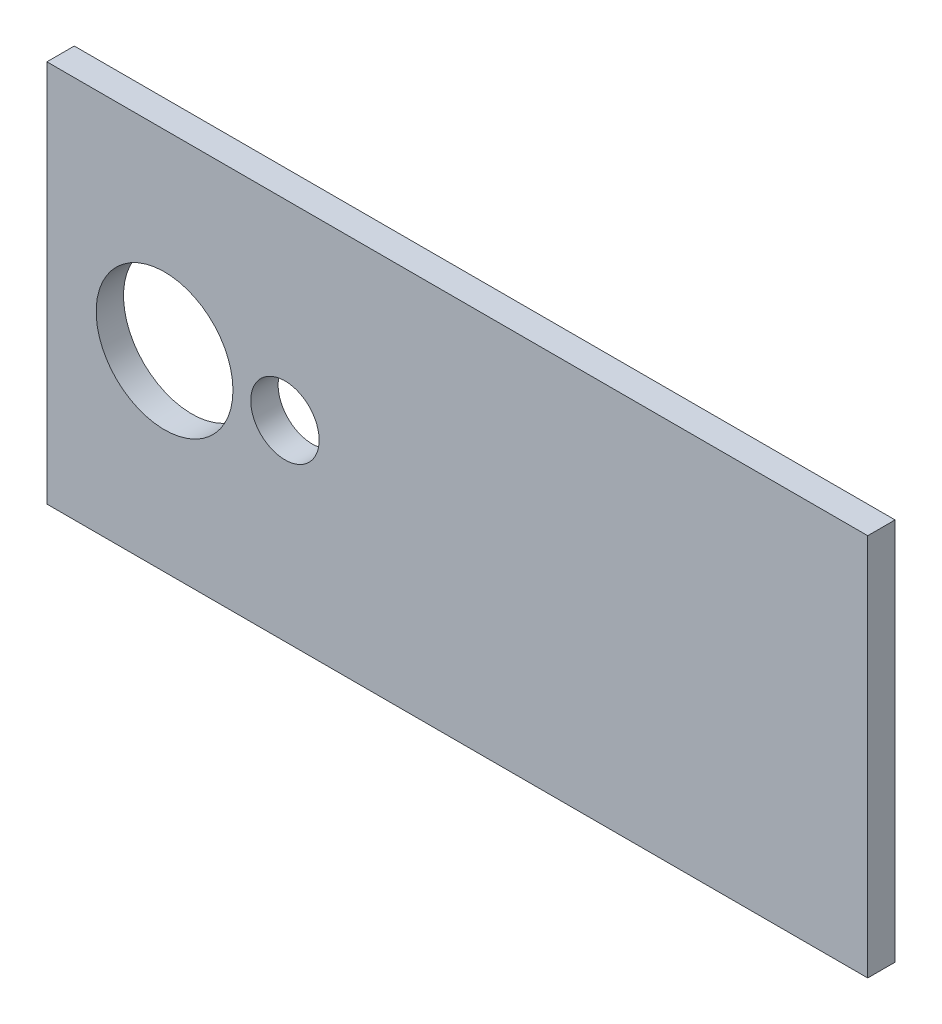
ISO-10303-21;
HEADER;
FILE_DESCRIPTION(('STEP AP214'),'2;1');
FILE_NAME('part.step','',(''),(''),'','','');
FILE_SCHEMA(('AUTOMOTIVE_DESIGN { 1 0 10303 214 1 1 1 1 }'));
ENDSEC;
DATA;
#1=APPLICATION_CONTEXT('core data for automotive mechanical design processes');
#2=APPLICATION_PROTOCOL_DEFINITION('international standard','automotive_design',2000,#1);
#3=PRODUCT_CONTEXT('',#1,'mechanical');
#4=PRODUCT('Part','Part','',(#3));
#5=PRODUCT_RELATED_PRODUCT_CATEGORY('part','',(#4));
#6=PRODUCT_DEFINITION_FORMATION('','',#4);
#7=PRODUCT_DEFINITION_CONTEXT('part definition',#1,'design');
#8=PRODUCT_DEFINITION('design','',#6,#7);
#9=PRODUCT_DEFINITION_SHAPE('','',#8);
#10=(LENGTH_UNIT() NAMED_UNIT(*) SI_UNIT(.MILLI.,.METRE.));
#11=(NAMED_UNIT(*) PLANE_ANGLE_UNIT() SI_UNIT($,.RADIAN.));
#12=(NAMED_UNIT(*) SI_UNIT($,.STERADIAN.) SOLID_ANGLE_UNIT());
#13=UNCERTAINTY_MEASURE_WITH_UNIT(LENGTH_MEASURE(1.E-05),#10,'distance_accuracy_value','');
#14=(GEOMETRIC_REPRESENTATION_CONTEXT(3) GLOBAL_UNCERTAINTY_ASSIGNED_CONTEXT((#13)) GLOBAL_UNIT_ASSIGNED_CONTEXT((#10,
#11,#12)) REPRESENTATION_CONTEXT('',''));
#15=CARTESIAN_POINT('',(0.,0.,0.));
#16=DIRECTION('',(0.,0.,1.));
#17=DIRECTION('',(1.,0.,0.));
#18=AXIS2_PLACEMENT_3D('',#15,#16,#17);
#19=CARTESIAN_POINT('',(0.,0.,3.175));
#20=DIRECTION('',(0.,0.,1.));
#21=DIRECTION('',(1.,0.,0.));
#22=AXIS2_PLACEMENT_3D('',#19,#20,#21);
#23=PLANE('',#22);
#24=CARTESIAN_POINT('',(-67.945,0.,3.175));
#25=DIRECTION('',(0.,0.,1.));
#26=DIRECTION('',(1.,0.,0.));
#27=AXIS2_PLACEMENT_3D('',#24,#25,#26);
#28=CIRCLE('',#27,15.875);
#29=CARTESIAN_POINT('',(-52.07,0.,3.175));
#30=VERTEX_POINT('',#29);
#31=EDGE_CURVE('E99',#30,#30,#28,.T.);
#32=ORIENTED_EDGE('',*,*,#31,.F.);
#33=EDGE_LOOP('',(#32));
#34=FACE_BOUND('',#33,.T.);
#35=DIRECTION('',(0.,1.,0.));
#36=VECTOR('',#35,1.);
#37=CARTESIAN_POINT('',(95.25,44.45,3.175));
#38=LINE('',#37,#36);
#39=CARTESIAN_POINT('',(95.25,-44.45,3.175));
#40=VERTEX_POINT('',#39);
#41=CARTESIAN_POINT('',(95.25,44.45,3.175));
#42=VERTEX_POINT('',#41);
#43=EDGE_CURVE('E84',#40,#42,#38,.T.);
#44=ORIENTED_EDGE('',*,*,#43,.T.);
#45=DIRECTION('',(-1.,0.,0.));
#46=VECTOR('',#45,1.);
#47=CARTESIAN_POINT('',(-95.25,44.45,3.175));
#48=LINE('',#47,#46);
#49=CARTESIAN_POINT('',(-95.25,44.45,3.175));
#50=VERTEX_POINT('',#49);
#51=EDGE_CURVE('E79',#42,#50,#48,.T.);
#52=ORIENTED_EDGE('',*,*,#51,.T.);
#53=DIRECTION('',(0.,-1.,0.));
#54=VECTOR('',#53,1.);
#55=CARTESIAN_POINT('',(-95.25,44.45,3.175));
#56=LINE('',#55,#54);
#57=CARTESIAN_POINT('',(-95.25,-44.45,3.175));
#58=VERTEX_POINT('',#57);
#59=EDGE_CURVE('E82',#50,#58,#56,.T.);
#60=ORIENTED_EDGE('',*,*,#59,.T.);
#61=DIRECTION('',(1.,0.,0.));
#62=VECTOR('',#61,1.);
#63=CARTESIAN_POINT('',(-95.25,-44.45,3.175));
#64=LINE('',#63,#62);
#65=EDGE_CURVE('E49',#58,#40,#64,.T.);
#66=ORIENTED_EDGE('',*,*,#65,.T.);
#67=EDGE_LOOP('',(#44,#52,#60,#66));
#68=FACE_BOUND('',#67,.T.);
#69=CARTESIAN_POINT('',(-40.005,0.,3.175));
#70=DIRECTION('',(0.,0.,1.));
#71=DIRECTION('',(1.,0.,0.));
#72=AXIS2_PLACEMENT_3D('',#69,#70,#71);
#73=CIRCLE('',#72,7.9375);
#74=CARTESIAN_POINT('',(-32.0675,0.,3.175));
#75=VERTEX_POINT('',#74);
#76=EDGE_CURVE('E114',#75,#75,#73,.T.);
#77=ORIENTED_EDGE('',*,*,#76,.F.);
#78=EDGE_LOOP('',(#77));
#79=FACE_BOUND('',#78,.T.);
#80=ADVANCED_FACE('F32',(#34,#68,#79),#23,.T.);
#81=CARTESIAN_POINT('',(0.,0.,-3.175));
#82=DIRECTION('',(0.,0.,1.));
#83=DIRECTION('',(1.,0.,0.));
#84=AXIS2_PLACEMENT_3D('',#81,#82,#83);
#85=PLANE('',#84);
#86=CARTESIAN_POINT('',(-67.945,0.,-3.175));
#87=DIRECTION('',(0.,0.,1.));
#88=DIRECTION('',(1.,0.,0.));
#89=AXIS2_PLACEMENT_3D('',#86,#87,#88);
#90=CIRCLE('',#89,15.875);
#91=CARTESIAN_POINT('',(-52.07,0.,-3.175));
#92=VERTEX_POINT('',#91);
#93=EDGE_CURVE('E111',#92,#92,#90,.T.);
#94=ORIENTED_EDGE('',*,*,#93,.T.);
#95=EDGE_LOOP('',(#94));
#96=FACE_BOUND('',#95,.T.);
#97=DIRECTION('',(0.,1.,0.));
#98=VECTOR('',#97,1.);
#99=CARTESIAN_POINT('',(95.25,44.45,-3.175));
#100=LINE('',#99,#98);
#101=CARTESIAN_POINT('',(95.25,-44.45,-3.175));
#102=VERTEX_POINT('',#101);
#103=CARTESIAN_POINT('',(95.25,44.45,-3.175));
#104=VERTEX_POINT('',#103);
#105=EDGE_CURVE('E96',#102,#104,#100,.T.);
#106=ORIENTED_EDGE('',*,*,#105,.F.);
#107=DIRECTION('',(1.,0.,0.));
#108=VECTOR('',#107,1.);
#109=CARTESIAN_POINT('',(-95.25,-44.45,-3.175));
#110=LINE('',#109,#108);
#111=CARTESIAN_POINT('',(-95.25,-44.45,-3.175));
#112=VERTEX_POINT('',#111);
#113=EDGE_CURVE('E72',#112,#102,#110,.T.);
#114=ORIENTED_EDGE('',*,*,#113,.F.);
#115=DIRECTION('',(0.,-1.,0.));
#116=VECTOR('',#115,1.);
#117=CARTESIAN_POINT('',(-95.25,44.45,-3.175));
#118=LINE('',#117,#116);
#119=CARTESIAN_POINT('',(-95.25,44.45,-3.175));
#120=VERTEX_POINT('',#119);
#121=EDGE_CURVE('E66',#120,#112,#118,.T.);
#122=ORIENTED_EDGE('',*,*,#121,.F.);
#123=DIRECTION('',(-1.,0.,0.));
#124=VECTOR('',#123,1.);
#125=CARTESIAN_POINT('',(-95.25,44.45,-3.175));
#126=LINE('',#125,#124);
#127=EDGE_CURVE('E88',#104,#120,#126,.T.);
#128=ORIENTED_EDGE('',*,*,#127,.F.);
#129=EDGE_LOOP('',(#106,#114,#122,#128));
#130=FACE_BOUND('',#129,.T.);
#131=CARTESIAN_POINT('',(-40.005,0.,-3.175));
#132=DIRECTION('',(0.,0.,1.));
#133=DIRECTION('',(1.,0.,0.));
#134=AXIS2_PLACEMENT_3D('',#131,#132,#133);
#135=CIRCLE('',#134,7.9375);
#136=CARTESIAN_POINT('',(-32.0675,0.,-3.175));
#137=VERTEX_POINT('',#136);
#138=EDGE_CURVE('E117',#137,#137,#135,.T.);
#139=ORIENTED_EDGE('',*,*,#138,.T.);
#140=EDGE_LOOP('',(#139));
#141=FACE_BOUND('',#140,.T.);
#142=ADVANCED_FACE('F107',(#96,#130,#141),#85,.F.);
#143=CARTESIAN_POINT('',(95.25,44.45,3.175));
#144=DIRECTION('',(-1.,0.,0.));
#145=DIRECTION('',(0.,-1.,0.));
#146=AXIS2_PLACEMENT_3D('',#143,#144,#145);
#147=PLANE('',#146);
#148=ORIENTED_EDGE('',*,*,#105,.T.);
#149=DIRECTION('',(0.,0.,-1.));
#150=VECTOR('',#149,1.);
#151=CARTESIAN_POINT('',(95.25,44.45,3.175));
#152=LINE('',#151,#150);
#153=EDGE_CURVE('E11',#42,#104,#152,.T.);
#154=ORIENTED_EDGE('',*,*,#153,.F.);
#155=ORIENTED_EDGE('',*,*,#43,.F.);
#156=DIRECTION('',(0.,0.,-1.));
#157=VECTOR('',#156,1.);
#158=CARTESIAN_POINT('',(95.25,-44.45,3.175));
#159=LINE('',#158,#157);
#160=EDGE_CURVE('E92',#40,#102,#159,.T.);
#161=ORIENTED_EDGE('',*,*,#160,.T.);
#162=EDGE_LOOP('',(#148,#154,#155,#161));
#163=FACE_BOUND('',#162,.T.);
#164=ADVANCED_FACE('F34',(#163),#147,.F.);
#165=CARTESIAN_POINT('',(-95.25,44.45,3.175));
#166=DIRECTION('',(0.,-1.,0.));
#167=DIRECTION('',(0.,0.,-1.));
#168=AXIS2_PLACEMENT_3D('',#165,#166,#167);
#169=PLANE('',#168);
#170=ORIENTED_EDGE('',*,*,#127,.T.);
#171=DIRECTION('',(0.,0.,-1.));
#172=VECTOR('',#171,1.);
#173=CARTESIAN_POINT('',(-95.25,44.45,3.175));
#174=LINE('',#173,#172);
#175=EDGE_CURVE('E41',#50,#120,#174,.T.);
#176=ORIENTED_EDGE('',*,*,#175,.F.);
#177=ORIENTED_EDGE('',*,*,#51,.F.);
#178=ORIENTED_EDGE('',*,*,#153,.T.);
#179=EDGE_LOOP('',(#170,#176,#177,#178));
#180=FACE_BOUND('',#179,.T.);
#181=ADVANCED_FACE('F87',(#180),#169,.F.);
#182=CARTESIAN_POINT('',(-95.25,44.45,3.175));
#183=DIRECTION('',(1.,0.,0.));
#184=DIRECTION('',(0.,1.,0.));
#185=AXIS2_PLACEMENT_3D('',#182,#183,#184);
#186=PLANE('',#185);
#187=ORIENTED_EDGE('',*,*,#121,.T.);
#188=DIRECTION('',(0.,0.,-1.));
#189=VECTOR('',#188,1.);
#190=CARTESIAN_POINT('',(-95.25,-44.45,3.175));
#191=LINE('',#190,#189);
#192=EDGE_CURVE('E89',#58,#112,#191,.T.);
#193=ORIENTED_EDGE('',*,*,#192,.F.);
#194=ORIENTED_EDGE('',*,*,#59,.F.);
#195=ORIENTED_EDGE('',*,*,#175,.T.);
#196=EDGE_LOOP('',(#187,#193,#194,#195));
#197=FACE_BOUND('',#196,.T.);
#198=ADVANCED_FACE('F90',(#197),#186,.F.);
#199=CARTESIAN_POINT('',(-95.25,-44.45,3.175));
#200=DIRECTION('',(0.,1.,0.));
#201=DIRECTION('',(0.,0.,1.));
#202=AXIS2_PLACEMENT_3D('',#199,#200,#201);
#203=PLANE('',#202);
#204=ORIENTED_EDGE('',*,*,#113,.T.);
#205=ORIENTED_EDGE('',*,*,#160,.F.);
#206=ORIENTED_EDGE('',*,*,#65,.F.);
#207=ORIENTED_EDGE('',*,*,#192,.T.);
#208=EDGE_LOOP('',(#204,#205,#206,#207));
#209=FACE_BOUND('',#208,.T.);
#210=ADVANCED_FACE('F104',(#209),#203,.F.);
#211=CARTESIAN_POINT('',(-67.945,0.,3.175));
#212=DIRECTION('',(0.,0.,-1.));
#213=DIRECTION('',(-1.,0.,0.));
#214=AXIS2_PLACEMENT_3D('',#211,#212,#213);
#215=CYLINDRICAL_SURFACE('',#214,15.875);
#216=ORIENTED_EDGE('',*,*,#31,.T.);
#217=EDGE_LOOP('',(#216));
#218=FACE_BOUND('',#217,.T.);
#219=ORIENTED_EDGE('',*,*,#93,.F.);
#220=EDGE_LOOP('',(#219));
#221=FACE_BOUND('',#220,.T.);
#222=ADVANCED_FACE('F135',(#218,#221),#215,.F.);
#223=CARTESIAN_POINT('',(-40.005,0.,3.175));
#224=DIRECTION('',(0.,0.,-1.));
#225=DIRECTION('',(-1.,0.,0.));
#226=AXIS2_PLACEMENT_3D('',#223,#224,#225);
#227=CYLINDRICAL_SURFACE('',#226,7.9375);
#228=ORIENTED_EDGE('',*,*,#76,.T.);
#229=EDGE_LOOP('',(#228));
#230=FACE_BOUND('',#229,.T.);
#231=ORIENTED_EDGE('',*,*,#138,.F.);
#232=EDGE_LOOP('',(#231));
#233=FACE_BOUND('',#232,.T.);
#234=ADVANCED_FACE('F123',(#230,#233),#227,.F.);
#235=CLOSED_SHELL('',(#80,#142,#164,#181,#198,#210,#222,#234));
#236=MANIFOLD_SOLID_BREP('B2',#235);
#237=ADVANCED_BREP_SHAPE_REPRESENTATION('',(#18,#236),#14);
#238=SHAPE_DEFINITION_REPRESENTATION(#9,#237);
ENDSEC;
END-ISO-10303-21;
